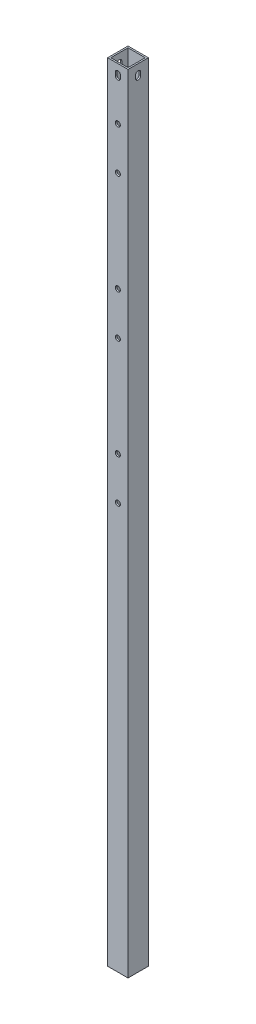
ISO-10303-21;
HEADER;
FILE_DESCRIPTION(('STEP AP214'),'2;1');
FILE_NAME('part.step','',(''),(''),'','','');
FILE_SCHEMA(('AUTOMOTIVE_DESIGN { 1 0 10303 214 1 1 1 1 }'));
ENDSEC;
DATA;
#1=APPLICATION_CONTEXT('core data for automotive mechanical design processes');
#2=APPLICATION_PROTOCOL_DEFINITION('international standard','automotive_design',2000,#1);
#3=PRODUCT_CONTEXT('',#1,'mechanical');
#4=PRODUCT('Part','Part','',(#3));
#5=PRODUCT_RELATED_PRODUCT_CATEGORY('part','',(#4));
#6=PRODUCT_DEFINITION_FORMATION('','',#4);
#7=PRODUCT_DEFINITION_CONTEXT('part definition',#1,'design');
#8=PRODUCT_DEFINITION('design','',#6,#7);
#9=PRODUCT_DEFINITION_SHAPE('','',#8);
#10=(LENGTH_UNIT() NAMED_UNIT(*) SI_UNIT(.MILLI.,.METRE.));
#11=(NAMED_UNIT(*) PLANE_ANGLE_UNIT() SI_UNIT($,.RADIAN.));
#12=(NAMED_UNIT(*) SI_UNIT($,.STERADIAN.) SOLID_ANGLE_UNIT());
#13=UNCERTAINTY_MEASURE_WITH_UNIT(LENGTH_MEASURE(1.E-05),#10,'distance_accuracy_value','');
#14=(GEOMETRIC_REPRESENTATION_CONTEXT(3) GLOBAL_UNCERTAINTY_ASSIGNED_CONTEXT((#13)) GLOBAL_UNIT_ASSIGNED_CONTEXT((#10,
#11,#12)) REPRESENTATION_CONTEXT('',''));
#15=CARTESIAN_POINT('',(0.,0.,0.));
#16=DIRECTION('',(0.,0.,1.));
#17=DIRECTION('',(1.,0.,0.));
#18=AXIS2_PLACEMENT_3D('',#15,#16,#17);
#19=CARTESIAN_POINT('',(0.,775.4,0.));
#20=DIRECTION('',(0.,1.,0.));
#21=DIRECTION('',(0.,0.,1.));
#22=AXIS2_PLACEMENT_3D('',#19,#20,#21);
#23=PLANE('',#22);
#24=DIRECTION('',(0.,0.,-1.));
#25=VECTOR('',#24,1.);
#26=CARTESIAN_POINT('',(10.,775.4,-10.));
#27=LINE('',#26,#25);
#28=CARTESIAN_POINT('',(10.,775.4,10.));
#29=VERTEX_POINT('',#28);
#30=CARTESIAN_POINT('',(10.,775.4,-10.));
#31=VERTEX_POINT('',#30);
#32=EDGE_CURVE('E350',#29,#31,#27,.T.);
#33=ORIENTED_EDGE('',*,*,#32,.T.);
#34=DIRECTION('',(-1.,0.,0.));
#35=VECTOR('',#34,1.);
#36=CARTESIAN_POINT('',(-10.,775.4,-10.));
#37=LINE('',#36,#35);
#38=CARTESIAN_POINT('',(-10.,775.4,-10.));
#39=VERTEX_POINT('',#38);
#40=EDGE_CURVE('E354',#31,#39,#37,.T.);
#41=ORIENTED_EDGE('',*,*,#40,.T.);
#42=DIRECTION('',(0.,0.,1.));
#43=VECTOR('',#42,1.);
#44=CARTESIAN_POINT('',(-10.,775.4,-10.));
#45=LINE('',#44,#43);
#46=CARTESIAN_POINT('',(-10.,775.4,10.));
#47=VERTEX_POINT('',#46);
#48=EDGE_CURVE('E358',#39,#47,#45,.T.);
#49=ORIENTED_EDGE('',*,*,#48,.T.);
#50=DIRECTION('',(1.,0.,0.));
#51=VECTOR('',#50,1.);
#52=CARTESIAN_POINT('',(-10.,775.4,10.));
#53=LINE('',#52,#51);
#54=EDGE_CURVE('E361',#47,#29,#53,.T.);
#55=ORIENTED_EDGE('',*,*,#54,.T.);
#56=EDGE_LOOP('',(#33,#41,#49,#55));
#57=FACE_BOUND('',#56,.T.);
#58=DIRECTION('',(1.,0.,0.));
#59=VECTOR('',#58,1.);
#60=CARTESIAN_POINT('',(-8.5,775.4,8.5));
#61=LINE('',#60,#59);
#62=CARTESIAN_POINT('',(-8.5,775.4,8.5));
#63=VERTEX_POINT('',#62);
#64=CARTESIAN_POINT('',(8.5,775.4,8.5));
#65=VERTEX_POINT('',#64);
#66=EDGE_CURVE('E310',#63,#65,#61,.T.);
#67=ORIENTED_EDGE('',*,*,#66,.F.);
#68=DIRECTION('',(0.,0.,1.));
#69=VECTOR('',#68,1.);
#70=CARTESIAN_POINT('',(-8.5,775.4,-8.5));
#71=LINE('',#70,#69);
#72=CARTESIAN_POINT('',(-8.5,775.4,-8.5));
#73=VERTEX_POINT('',#72);
#74=EDGE_CURVE('E307',#73,#63,#71,.T.);
#75=ORIENTED_EDGE('',*,*,#74,.F.);
#76=DIRECTION('',(-1.,0.,0.));
#77=VECTOR('',#76,1.);
#78=CARTESIAN_POINT('',(-8.5,775.4,-8.5));
#79=LINE('',#78,#77);
#80=CARTESIAN_POINT('',(8.5,775.4,-8.5));
#81=VERTEX_POINT('',#80);
#82=EDGE_CURVE('E318',#81,#73,#79,.T.);
#83=ORIENTED_EDGE('',*,*,#82,.F.);
#84=DIRECTION('',(0.,0.,-1.));
#85=VECTOR('',#84,1.);
#86=CARTESIAN_POINT('',(8.5,775.4,-8.5));
#87=LINE('',#86,#85);
#88=EDGE_CURVE('E314',#65,#81,#87,.T.);
#89=ORIENTED_EDGE('',*,*,#88,.F.);
#90=EDGE_LOOP('',(#67,#75,#83,#89));
#91=FACE_BOUND('',#90,.T.);
#92=ADVANCED_FACE('F45',(#57,#91),#23,.T.);
#93=CARTESIAN_POINT('',(0.,0.,0.));
#94=DIRECTION('',(0.,1.,0.));
#95=DIRECTION('',(0.,0.,1.));
#96=AXIS2_PLACEMENT_3D('',#93,#94,#95);
#97=PLANE('',#96);
#98=DIRECTION('',(0.,0.,-1.));
#99=VECTOR('',#98,1.);
#100=CARTESIAN_POINT('',(10.,0.,-10.));
#101=LINE('',#100,#99);
#102=CARTESIAN_POINT('',(10.,0.,10.));
#103=VERTEX_POINT('',#102);
#104=CARTESIAN_POINT('',(10.,0.,-10.));
#105=VERTEX_POINT('',#104);
#106=EDGE_CURVE('E349',#103,#105,#101,.T.);
#107=ORIENTED_EDGE('',*,*,#106,.F.);
#108=DIRECTION('',(1.,0.,0.));
#109=VECTOR('',#108,1.);
#110=CARTESIAN_POINT('',(-10.,0.,10.));
#111=LINE('',#110,#109);
#112=CARTESIAN_POINT('',(-10.,0.,10.));
#113=VERTEX_POINT('',#112);
#114=EDGE_CURVE('E355',#113,#103,#111,.T.);
#115=ORIENTED_EDGE('',*,*,#114,.F.);
#116=DIRECTION('',(0.,0.,1.));
#117=VECTOR('',#116,1.);
#118=CARTESIAN_POINT('',(-10.,0.,-10.));
#119=LINE('',#118,#117);
#120=CARTESIAN_POINT('',(-10.,0.,-10.));
#121=VERTEX_POINT('',#120);
#122=EDGE_CURVE('E371',#121,#113,#119,.T.);
#123=ORIENTED_EDGE('',*,*,#122,.F.);
#124=DIRECTION('',(-1.,0.,0.));
#125=VECTOR('',#124,1.);
#126=CARTESIAN_POINT('',(-10.,0.,-10.));
#127=LINE('',#126,#125);
#128=EDGE_CURVE('E368',#105,#121,#127,.T.);
#129=ORIENTED_EDGE('',*,*,#128,.F.);
#130=EDGE_LOOP('',(#107,#115,#123,#129));
#131=FACE_BOUND('',#130,.T.);
#132=DIRECTION('',(0.,0.,1.));
#133=VECTOR('',#132,1.);
#134=CARTESIAN_POINT('',(-8.5,0.,-8.5));
#135=LINE('',#134,#133);
#136=CARTESIAN_POINT('',(-8.5,0.,-8.5));
#137=VERTEX_POINT('',#136);
#138=CARTESIAN_POINT('',(-8.5,0.,8.5));
#139=VERTEX_POINT('',#138);
#140=EDGE_CURVE('E297',#137,#139,#135,.T.);
#141=ORIENTED_EDGE('',*,*,#140,.T.);
#142=DIRECTION('',(1.,0.,0.));
#143=VECTOR('',#142,1.);
#144=CARTESIAN_POINT('',(-8.5,0.,8.5));
#145=LINE('',#144,#143);
#146=CARTESIAN_POINT('',(8.5,0.,8.5));
#147=VERTEX_POINT('',#146);
#148=EDGE_CURVE('E325',#139,#147,#145,.T.);
#149=ORIENTED_EDGE('',*,*,#148,.T.);
#150=DIRECTION('',(0.,0.,-1.));
#151=VECTOR('',#150,1.);
#152=CARTESIAN_POINT('',(8.5,0.,-8.5));
#153=LINE('',#152,#151);
#154=CARTESIAN_POINT('',(8.5,0.,-8.5));
#155=VERTEX_POINT('',#154);
#156=EDGE_CURVE('E329',#147,#155,#153,.T.);
#157=ORIENTED_EDGE('',*,*,#156,.T.);
#158=DIRECTION('',(-1.,0.,0.));
#159=VECTOR('',#158,1.);
#160=CARTESIAN_POINT('',(-8.5,0.,-8.5));
#161=LINE('',#160,#159);
#162=EDGE_CURVE('E311',#155,#137,#161,.T.);
#163=ORIENTED_EDGE('',*,*,#162,.T.);
#164=EDGE_LOOP('',(#141,#149,#157,#163));
#165=FACE_BOUND('',#164,.T.);
#166=ADVANCED_FACE('F459',(#131,#165),#97,.F.);
#167=CARTESIAN_POINT('',(10.,775.4,-10.));
#168=DIRECTION('',(-1.,0.,0.));
#169=DIRECTION('',(0.,0.,1.));
#170=AXIS2_PLACEMENT_3D('',#167,#168,#169);
#171=PLANE('',#170);
#172=DIRECTION('',(0.,1.,0.));
#173=VECTOR('',#172,1.);
#174=CARTESIAN_POINT('',(10.,775.4,2.5));
#175=LINE('',#174,#173);
#176=CARTESIAN_POINT('',(9.99999999999999,763.9,2.5));
#177=VERTEX_POINT('',#176);
#178=CARTESIAN_POINT('',(9.99999999999999,766.9,2.5));
#179=VERTEX_POINT('',#178);
#180=EDGE_CURVE('E241',#177,#179,#175,.T.);
#181=ORIENTED_EDGE('',*,*,#180,.T.);
#182=CARTESIAN_POINT('',(9.99999999999999,766.9,0.));
#183=DIRECTION('',(-1.,0.,0.));
#184=DIRECTION('',(0.,0.,1.));
#185=AXIS2_PLACEMENT_3D('',#182,#183,#184);
#186=CIRCLE('',#185,2.5);
#187=CARTESIAN_POINT('',(9.99999999999999,766.9,-2.50000000000001));
#188=VERTEX_POINT('',#187);
#189=EDGE_CURVE('E248',#179,#188,#186,.T.);
#190=ORIENTED_EDGE('',*,*,#189,.T.);
#191=DIRECTION('',(0.,-1.,0.));
#192=VECTOR('',#191,1.);
#193=CARTESIAN_POINT('',(10.,775.4,-2.50000000000001));
#194=LINE('',#193,#192);
#195=CARTESIAN_POINT('',(10.,763.9,-2.5));
#196=VERTEX_POINT('',#195);
#197=EDGE_CURVE('E228',#188,#196,#194,.T.);
#198=ORIENTED_EDGE('',*,*,#197,.T.);
#199=CARTESIAN_POINT('',(9.99999999999999,763.9,0.));
#200=DIRECTION('',(-1.,0.,0.));
#201=DIRECTION('',(0.,0.,1.));
#202=AXIS2_PLACEMENT_3D('',#199,#200,#201);
#203=CIRCLE('',#202,2.5);
#204=EDGE_CURVE('E234',#196,#177,#203,.T.);
#205=ORIENTED_EDGE('',*,*,#204,.T.);
#206=EDGE_LOOP('',(#181,#190,#198,#205));
#207=FACE_BOUND('',#206,.T.);
#208=ORIENTED_EDGE('',*,*,#106,.T.);
#209=DIRECTION('',(0.,-1.,0.));
#210=VECTOR('',#209,1.);
#211=CARTESIAN_POINT('',(10.,775.4,-10.));
#212=LINE('',#211,#210);
#213=EDGE_CURVE('E387',#31,#105,#212,.T.);
#214=ORIENTED_EDGE('',*,*,#213,.F.);
#215=ORIENTED_EDGE('',*,*,#32,.F.);
#216=DIRECTION('',(0.,-1.,0.));
#217=VECTOR('',#216,1.);
#218=CARTESIAN_POINT('',(10.,775.4,10.));
#219=LINE('',#218,#217);
#220=EDGE_CURVE('E364',#29,#103,#219,.T.);
#221=ORIENTED_EDGE('',*,*,#220,.T.);
#222=EDGE_LOOP('',(#208,#214,#215,#221));
#223=FACE_BOUND('',#222,.T.);
#224=ADVANCED_FACE('F47',(#207,#223),#171,.F.);
#225=CARTESIAN_POINT('',(-10.,775.4,-10.));
#226=DIRECTION('',(0.,0.,1.));
#227=DIRECTION('',(1.,0.,0.));
#228=AXIS2_PLACEMENT_3D('',#225,#226,#227);
#229=PLANE('',#228);
#230=ORIENTED_EDGE('',*,*,#128,.T.);
#231=DIRECTION('',(0.,-1.,0.));
#232=VECTOR('',#231,1.);
#233=CARTESIAN_POINT('',(-10.,775.4,-10.));
#234=LINE('',#233,#232);
#235=EDGE_CURVE('E383',#39,#121,#234,.T.);
#236=ORIENTED_EDGE('',*,*,#235,.F.);
#237=ORIENTED_EDGE('',*,*,#40,.F.);
#238=ORIENTED_EDGE('',*,*,#213,.T.);
#239=EDGE_LOOP('',(#230,#236,#237,#238));
#240=FACE_BOUND('',#239,.T.);
#241=ADVANCED_FACE('F458',(#240),#229,.F.);
#242=CARTESIAN_POINT('',(-10.,775.4,-10.));
#243=DIRECTION('',(1.,0.,0.));
#244=DIRECTION('',(0.,0.,-1.));
#245=AXIS2_PLACEMENT_3D('',#242,#243,#244);
#246=PLANE('',#245);
#247=DIRECTION('',(0.,-1.,0.));
#248=VECTOR('',#247,1.);
#249=CARTESIAN_POINT('',(-10.,766.9,-2.5));
#250=LINE('',#249,#248);
#251=CARTESIAN_POINT('',(-10.,766.9,-2.5));
#252=VERTEX_POINT('',#251);
#253=CARTESIAN_POINT('',(-10.,763.9,-2.5));
#254=VERTEX_POINT('',#253);
#255=EDGE_CURVE('E199',#252,#254,#250,.T.);
#256=ORIENTED_EDGE('',*,*,#255,.F.);
#257=CARTESIAN_POINT('',(-10.,766.9,0.));
#258=DIRECTION('',(-1.,0.,0.));
#259=DIRECTION('',(0.,0.,1.));
#260=AXIS2_PLACEMENT_3D('',#257,#258,#259);
#261=CIRCLE('',#260,2.5);
#262=CARTESIAN_POINT('',(-10.,766.9,2.5));
#263=VERTEX_POINT('',#262);
#264=EDGE_CURVE('E69',#263,#252,#261,.T.);
#265=ORIENTED_EDGE('',*,*,#264,.F.);
#266=DIRECTION('',(0.,1.,0.));
#267=VECTOR('',#266,1.);
#268=CARTESIAN_POINT('',(-10.,766.9,2.5));
#269=LINE('',#268,#267);
#270=CARTESIAN_POINT('',(-10.,763.9,2.5));
#271=VERTEX_POINT('',#270);
#272=EDGE_CURVE('E208',#271,#263,#269,.T.);
#273=ORIENTED_EDGE('',*,*,#272,.F.);
#274=CARTESIAN_POINT('',(-10.,763.9,0.));
#275=DIRECTION('',(-1.,0.,0.));
#276=DIRECTION('',(0.,0.,1.));
#277=AXIS2_PLACEMENT_3D('',#274,#275,#276);
#278=CIRCLE('',#277,2.5);
#279=EDGE_CURVE('E189',#254,#271,#278,.T.);
#280=ORIENTED_EDGE('',*,*,#279,.F.);
#281=EDGE_LOOP('',(#256,#265,#273,#280));
#282=FACE_BOUND('',#281,.T.);
#283=ORIENTED_EDGE('',*,*,#122,.T.);
#284=DIRECTION('',(0.,-1.,0.));
#285=VECTOR('',#284,1.);
#286=CARTESIAN_POINT('',(-10.,775.4,10.));
#287=LINE('',#286,#285);
#288=EDGE_CURVE('E379',#47,#113,#287,.T.);
#289=ORIENTED_EDGE('',*,*,#288,.F.);
#290=ORIENTED_EDGE('',*,*,#48,.F.);
#291=ORIENTED_EDGE('',*,*,#235,.T.);
#292=EDGE_LOOP('',(#283,#289,#290,#291));
#293=FACE_BOUND('',#292,.T.);
#294=ADVANCED_FACE('F205',(#282,#293),#246,.F.);
#295=CARTESIAN_POINT('',(-10.,775.4,10.));
#296=DIRECTION('',(0.,0.,-1.));
#297=DIRECTION('',(-1.,0.,0.));
#298=AXIS2_PLACEMENT_3D('',#295,#296,#297);
#299=PLANE('',#298);
#300=CARTESIAN_POINT('',(0.,723.9,10.));
#301=DIRECTION('',(0.,0.,1.));
#302=DIRECTION('',(1.,0.,0.));
#303=AXIS2_PLACEMENT_3D('',#300,#301,#302);
#304=CIRCLE('',#303,2.5);
#305=CARTESIAN_POINT('',(2.50000000000001,723.9,10.));
#306=VERTEX_POINT('',#305);
#307=EDGE_CURVE('E253',#306,#306,#304,.T.);
#308=ORIENTED_EDGE('',*,*,#307,.F.);
#309=EDGE_LOOP('',(#308));
#310=FACE_BOUND('',#309,.T.);
#311=CARTESIAN_POINT('',(0.,583.1,10.));
#312=DIRECTION('',(0.,0.,1.));
#313=DIRECTION('',(1.,0.,0.));
#314=AXIS2_PLACEMENT_3D('',#311,#312,#313);
#315=CIRCLE('',#314,2.5);
#316=CARTESIAN_POINT('',(2.50000000000001,583.1,10.));
#317=VERTEX_POINT('',#316);
#318=EDGE_CURVE('E252',#317,#317,#315,.T.);
#319=ORIENTED_EDGE('',*,*,#318,.F.);
#320=EDGE_LOOP('',(#319));
#321=FACE_BOUND('',#320,.T.);
#322=CARTESIAN_POINT('',(0.,400.3,10.));
#323=DIRECTION('',(0.,0.,1.));
#324=DIRECTION('',(1.,0.,0.));
#325=AXIS2_PLACEMENT_3D('',#322,#323,#324);
#326=CIRCLE('',#325,2.5);
#327=CARTESIAN_POINT('',(2.50000000000001,400.3,10.));
#328=VERTEX_POINT('',#327);
#329=EDGE_CURVE('E262',#328,#328,#326,.T.);
#330=ORIENTED_EDGE('',*,*,#329,.F.);
#331=EDGE_LOOP('',(#330));
#332=FACE_BOUND('',#331,.T.);
#333=CARTESIAN_POINT('',(0.,442.3,10.));
#334=DIRECTION('',(0.,0.,1.));
#335=DIRECTION('',(1.,0.,0.));
#336=AXIS2_PLACEMENT_3D('',#333,#334,#335);
#337=CIRCLE('',#336,2.5);
#338=CARTESIAN_POINT('',(2.50000000000001,442.3,10.));
#339=VERTEX_POINT('',#338);
#340=EDGE_CURVE('E270',#339,#339,#337,.T.);
#341=ORIENTED_EDGE('',*,*,#340,.F.);
#342=EDGE_LOOP('',(#341));
#343=FACE_BOUND('',#342,.T.);
#344=CARTESIAN_POINT('',(0.,541.1,10.));
#345=DIRECTION('',(0.,0.,1.));
#346=DIRECTION('',(1.,0.,0.));
#347=AXIS2_PLACEMENT_3D('',#344,#345,#346);
#348=CIRCLE('',#347,2.5);
#349=CARTESIAN_POINT('',(2.50000000000001,541.1,10.));
#350=VERTEX_POINT('',#349);
#351=EDGE_CURVE('E266',#350,#350,#348,.T.);
#352=ORIENTED_EDGE('',*,*,#351,.F.);
#353=EDGE_LOOP('',(#352));
#354=FACE_BOUND('',#353,.T.);
#355=CARTESIAN_POINT('',(0.,681.9,10.));
#356=DIRECTION('',(0.,0.,1.));
#357=DIRECTION('',(1.,0.,0.));
#358=AXIS2_PLACEMENT_3D('',#355,#356,#357);
#359=CIRCLE('',#358,2.5);
#360=CARTESIAN_POINT('',(2.50000000000001,681.9,10.));
#361=VERTEX_POINT('',#360);
#362=EDGE_CURVE('E258',#361,#361,#359,.T.);
#363=ORIENTED_EDGE('',*,*,#362,.F.);
#364=EDGE_LOOP('',(#363));
#365=FACE_BOUND('',#364,.T.);
#366=DIRECTION('',(0.,-1.,0.));
#367=VECTOR('',#366,1.);
#368=CARTESIAN_POINT('',(-2.5,766.9,10.));
#369=LINE('',#368,#367);
#370=CARTESIAN_POINT('',(-2.5,766.9,10.));
#371=VERTEX_POINT('',#370);
#372=CARTESIAN_POINT('',(-2.5,763.9,10.));
#373=VERTEX_POINT('',#372);
#374=EDGE_CURVE('E280',#371,#373,#369,.T.);
#375=ORIENTED_EDGE('',*,*,#374,.F.);
#376=CARTESIAN_POINT('',(0.,766.9,10.));
#377=DIRECTION('',(0.,0.,1.));
#378=DIRECTION('',(1.,0.,0.));
#379=AXIS2_PLACEMENT_3D('',#376,#377,#378);
#380=CIRCLE('',#379,2.5);
#381=CARTESIAN_POINT('',(2.5,766.9,10.));
#382=VERTEX_POINT('',#381);
#383=EDGE_CURVE('E277',#382,#371,#380,.T.);
#384=ORIENTED_EDGE('',*,*,#383,.F.);
#385=DIRECTION('',(0.,1.,0.));
#386=VECTOR('',#385,1.);
#387=CARTESIAN_POINT('',(2.5,766.9,10.));
#388=LINE('',#387,#386);
#389=CARTESIAN_POINT('',(2.5,763.9,10.));
#390=VERTEX_POINT('',#389);
#391=EDGE_CURVE('E289',#390,#382,#388,.T.);
#392=ORIENTED_EDGE('',*,*,#391,.F.);
#393=CARTESIAN_POINT('',(0.,763.9,10.));
#394=DIRECTION('',(0.,0.,1.));
#395=DIRECTION('',(1.,0.,0.));
#396=AXIS2_PLACEMENT_3D('',#393,#394,#395);
#397=CIRCLE('',#396,2.5);
#398=EDGE_CURVE('E285',#373,#390,#397,.T.);
#399=ORIENTED_EDGE('',*,*,#398,.F.);
#400=EDGE_LOOP('',(#375,#384,#392,#399));
#401=FACE_BOUND('',#400,.T.);
#402=ORIENTED_EDGE('',*,*,#114,.T.);
#403=ORIENTED_EDGE('',*,*,#220,.F.);
#404=ORIENTED_EDGE('',*,*,#54,.F.);
#405=ORIENTED_EDGE('',*,*,#288,.T.);
#406=EDGE_LOOP('',(#402,#403,#404,#405));
#407=FACE_BOUND('',#406,.T.);
#408=ADVANCED_FACE('F476',(#310,#321,#332,#343,#354,#365,#401,#407),#299,.F.);
#409=CARTESIAN_POINT('',(-8.5,775.4,-8.5));
#410=DIRECTION('',(1.,0.,0.));
#411=DIRECTION('',(0.,0.,-1.));
#412=AXIS2_PLACEMENT_3D('',#409,#410,#411);
#413=PLANE('',#412);
#414=CARTESIAN_POINT('',(-8.49999999999999,766.9,0.));
#415=DIRECTION('',(1.,0.,0.));
#416=DIRECTION('',(0.,0.,-1.));
#417=AXIS2_PLACEMENT_3D('',#414,#415,#416);
#418=CIRCLE('',#417,2.5);
#419=CARTESIAN_POINT('',(-8.49999999999999,766.9,-2.5));
#420=VERTEX_POINT('',#419);
#421=CARTESIAN_POINT('',(-8.49999999999999,766.9,2.5));
#422=VERTEX_POINT('',#421);
#423=EDGE_CURVE('E245',#420,#422,#418,.T.);
#424=ORIENTED_EDGE('',*,*,#423,.F.);
#425=DIRECTION('',(0.,1.,0.));
#426=VECTOR('',#425,1.);
#427=CARTESIAN_POINT('',(-8.5,775.4,-2.50000000000001));
#428=LINE('',#427,#426);
#429=CARTESIAN_POINT('',(-8.5,763.9,-2.5));
#430=VERTEX_POINT('',#429);
#431=EDGE_CURVE('E225',#430,#420,#428,.T.);
#432=ORIENTED_EDGE('',*,*,#431,.F.);
#433=CARTESIAN_POINT('',(-8.49999999999999,763.9,0.));
#434=DIRECTION('',(1.,0.,0.));
#435=DIRECTION('',(0.,0.,-1.));
#436=AXIS2_PLACEMENT_3D('',#433,#434,#435);
#437=CIRCLE('',#436,2.5);
#438=CARTESIAN_POINT('',(-8.49999999999999,763.9,2.5));
#439=VERTEX_POINT('',#438);
#440=EDGE_CURVE('E192',#439,#430,#437,.T.);
#441=ORIENTED_EDGE('',*,*,#440,.F.);
#442=DIRECTION('',(0.,-1.,0.));
#443=VECTOR('',#442,1.);
#444=CARTESIAN_POINT('',(-8.5,775.4,2.5));
#445=LINE('',#444,#443);
#446=EDGE_CURVE('E238',#422,#439,#445,.T.);
#447=ORIENTED_EDGE('',*,*,#446,.F.);
#448=EDGE_LOOP('',(#424,#432,#441,#447));
#449=FACE_BOUND('',#448,.T.);
#450=ORIENTED_EDGE('',*,*,#140,.F.);
#451=DIRECTION('',(0.,-1.,0.));
#452=VECTOR('',#451,1.);
#453=CARTESIAN_POINT('',(-8.5,775.4,-8.5));
#454=LINE('',#453,#452);
#455=EDGE_CURVE('E321',#73,#137,#454,.T.);
#456=ORIENTED_EDGE('',*,*,#455,.F.);
#457=ORIENTED_EDGE('',*,*,#74,.T.);
#458=DIRECTION('',(0.,-1.,0.));
#459=VECTOR('',#458,1.);
#460=CARTESIAN_POINT('',(-8.5,775.4,8.5));
#461=LINE('',#460,#459);
#462=EDGE_CURVE('E345',#63,#139,#461,.T.);
#463=ORIENTED_EDGE('',*,*,#462,.T.);
#464=EDGE_LOOP('',(#450,#456,#457,#463));
#465=FACE_BOUND('',#464,.T.);
#466=ADVANCED_FACE('F483',(#449,#465),#413,.T.);
#467=CARTESIAN_POINT('',(-8.5,775.4,8.5));
#468=DIRECTION('',(0.,0.,-1.));
#469=DIRECTION('',(-1.,0.,0.));
#470=AXIS2_PLACEMENT_3D('',#467,#468,#469);
#471=PLANE('',#470);
#472=CARTESIAN_POINT('',(0.,723.9,8.5));
#473=DIRECTION('',(0.,0.,-1.));
#474=DIRECTION('',(-1.,0.,0.));
#475=AXIS2_PLACEMENT_3D('',#472,#473,#474);
#476=CIRCLE('',#475,2.5);
#477=CARTESIAN_POINT('',(-2.5,723.9,8.5));
#478=VERTEX_POINT('',#477);
#479=EDGE_CURVE('E281',#478,#478,#476,.T.);
#480=ORIENTED_EDGE('',*,*,#479,.F.);
#481=EDGE_LOOP('',(#480));
#482=FACE_BOUND('',#481,.T.);
#483=CARTESIAN_POINT('',(0.,583.1,8.5));
#484=DIRECTION('',(0.,0.,-1.));
#485=DIRECTION('',(-1.,0.,0.));
#486=AXIS2_PLACEMENT_3D('',#483,#484,#485);
#487=CIRCLE('',#486,2.5);
#488=CARTESIAN_POINT('',(-2.5,583.1,8.5));
#489=VERTEX_POINT('',#488);
#490=EDGE_CURVE('E420',#489,#489,#487,.T.);
#491=ORIENTED_EDGE('',*,*,#490,.F.);
#492=EDGE_LOOP('',(#491));
#493=FACE_BOUND('',#492,.T.);
#494=CARTESIAN_POINT('',(0.,400.3,8.5));
#495=DIRECTION('',(0.,0.,-1.));
#496=DIRECTION('',(-1.,0.,0.));
#497=AXIS2_PLACEMENT_3D('',#494,#495,#496);
#498=CIRCLE('',#497,2.5);
#499=CARTESIAN_POINT('',(-2.5,400.3,8.5));
#500=VERTEX_POINT('',#499);
#501=EDGE_CURVE('E416',#500,#500,#498,.T.);
#502=ORIENTED_EDGE('',*,*,#501,.F.);
#503=EDGE_LOOP('',(#502));
#504=FACE_BOUND('',#503,.T.);
#505=CARTESIAN_POINT('',(0.,442.3,8.5));
#506=DIRECTION('',(0.,0.,-1.));
#507=DIRECTION('',(-1.,0.,0.));
#508=AXIS2_PLACEMENT_3D('',#505,#506,#507);
#509=CIRCLE('',#508,2.5);
#510=CARTESIAN_POINT('',(-2.5,442.3,8.5));
#511=VERTEX_POINT('',#510);
#512=EDGE_CURVE('E412',#511,#511,#509,.T.);
#513=ORIENTED_EDGE('',*,*,#512,.F.);
#514=EDGE_LOOP('',(#513));
#515=FACE_BOUND('',#514,.T.);
#516=CARTESIAN_POINT('',(0.,541.1,8.5));
#517=DIRECTION('',(0.,0.,-1.));
#518=DIRECTION('',(-1.,0.,0.));
#519=AXIS2_PLACEMENT_3D('',#516,#517,#518);
#520=CIRCLE('',#519,2.5);
#521=CARTESIAN_POINT('',(-2.5,541.1,8.5));
#522=VERTEX_POINT('',#521);
#523=EDGE_CURVE('E408',#522,#522,#520,.T.);
#524=ORIENTED_EDGE('',*,*,#523,.F.);
#525=EDGE_LOOP('',(#524));
#526=FACE_BOUND('',#525,.T.);
#527=CARTESIAN_POINT('',(0.,681.9,8.5));
#528=DIRECTION('',(0.,0.,-1.));
#529=DIRECTION('',(-1.,0.,0.));
#530=AXIS2_PLACEMENT_3D('',#527,#528,#529);
#531=CIRCLE('',#530,2.5);
#532=CARTESIAN_POINT('',(-2.5,681.9,8.5));
#533=VERTEX_POINT('',#532);
#534=EDGE_CURVE('E257',#533,#533,#531,.T.);
#535=ORIENTED_EDGE('',*,*,#534,.F.);
#536=EDGE_LOOP('',(#535));
#537=FACE_BOUND('',#536,.T.);
#538=CARTESIAN_POINT('',(0.,766.9,8.5));
#539=DIRECTION('',(0.,0.,-1.));
#540=DIRECTION('',(-1.,0.,0.));
#541=AXIS2_PLACEMENT_3D('',#538,#539,#540);
#542=CIRCLE('',#541,2.5);
#543=CARTESIAN_POINT('',(-2.5,766.9,8.5));
#544=VERTEX_POINT('',#543);
#545=CARTESIAN_POINT('',(2.5,766.9,8.5));
#546=VERTEX_POINT('',#545);
#547=EDGE_CURVE('E401',#544,#546,#542,.T.);
#548=ORIENTED_EDGE('',*,*,#547,.F.);
#549=DIRECTION('',(0.,1.,0.));
#550=VECTOR('',#549,1.);
#551=CARTESIAN_POINT('',(-2.50000000000001,775.4,8.5));
#552=LINE('',#551,#550);
#553=CARTESIAN_POINT('',(-2.5,763.9,8.5));
#554=VERTEX_POINT('',#553);
#555=EDGE_CURVE('E391',#554,#544,#552,.T.);
#556=ORIENTED_EDGE('',*,*,#555,.F.);
#557=CARTESIAN_POINT('',(0.,763.9,8.5));
#558=DIRECTION('',(0.,0.,-1.));
#559=DIRECTION('',(-1.,0.,0.));
#560=AXIS2_PLACEMENT_3D('',#557,#558,#559);
#561=CIRCLE('',#560,2.5);
#562=CARTESIAN_POINT('',(2.5,763.9,8.5));
#563=VERTEX_POINT('',#562);
#564=EDGE_CURVE('E394',#563,#554,#561,.T.);
#565=ORIENTED_EDGE('',*,*,#564,.F.);
#566=DIRECTION('',(0.,-1.,0.));
#567=VECTOR('',#566,1.);
#568=CARTESIAN_POINT('',(2.5,775.4,8.5));
#569=LINE('',#568,#567);
#570=EDGE_CURVE('E398',#546,#563,#569,.T.);
#571=ORIENTED_EDGE('',*,*,#570,.F.);
#572=EDGE_LOOP('',(#548,#556,#565,#571));
#573=FACE_BOUND('',#572,.T.);
#574=ORIENTED_EDGE('',*,*,#148,.F.);
#575=ORIENTED_EDGE('',*,*,#462,.F.);
#576=ORIENTED_EDGE('',*,*,#66,.T.);
#577=DIRECTION('',(0.,-1.,0.));
#578=VECTOR('',#577,1.);
#579=CARTESIAN_POINT('',(8.5,775.4,8.5));
#580=LINE('',#579,#578);
#581=EDGE_CURVE('E342',#65,#147,#580,.T.);
#582=ORIENTED_EDGE('',*,*,#581,.T.);
#583=EDGE_LOOP('',(#574,#575,#576,#582));
#584=FACE_BOUND('',#583,.T.);
#585=ADVANCED_FACE('F495',(#482,#493,#504,#515,#526,#537,#573,#584),#471,.T.);
#586=CARTESIAN_POINT('',(8.5,775.4,-8.5));
#587=DIRECTION('',(-1.,0.,0.));
#588=DIRECTION('',(0.,0.,1.));
#589=AXIS2_PLACEMENT_3D('',#586,#587,#588);
#590=PLANE('',#589);
#591=CARTESIAN_POINT('',(8.49999999999999,766.9,0.));
#592=DIRECTION('',(-1.,0.,0.));
#593=DIRECTION('',(0.,0.,1.));
#594=AXIS2_PLACEMENT_3D('',#591,#592,#593);
#595=CIRCLE('',#594,2.5);
#596=CARTESIAN_POINT('',(8.49999999999999,766.9,2.5));
#597=VERTEX_POINT('',#596);
#598=CARTESIAN_POINT('',(8.5,766.9,-2.5));
#599=VERTEX_POINT('',#598);
#600=EDGE_CURVE('E11',#597,#599,#595,.T.);
#601=ORIENTED_EDGE('',*,*,#600,.F.);
#602=DIRECTION('',(0.,1.,0.));
#603=VECTOR('',#602,1.);
#604=CARTESIAN_POINT('',(8.5,775.4,2.5));
#605=LINE('',#604,#603);
#606=CARTESIAN_POINT('',(8.49999999999999,763.9,2.5));
#607=VERTEX_POINT('',#606);
#608=EDGE_CURVE('E54',#607,#597,#605,.T.);
#609=ORIENTED_EDGE('',*,*,#608,.F.);
#610=CARTESIAN_POINT('',(8.49999999999999,763.9,0.));
#611=DIRECTION('',(-1.,0.,0.));
#612=DIRECTION('',(0.,0.,1.));
#613=AXIS2_PLACEMENT_3D('',#610,#611,#612);
#614=CIRCLE('',#613,2.5);
#615=CARTESIAN_POINT('',(8.49999999999999,763.9,-2.5));
#616=VERTEX_POINT('',#615);
#617=EDGE_CURVE('E429',#616,#607,#614,.T.);
#618=ORIENTED_EDGE('',*,*,#617,.F.);
#619=DIRECTION('',(0.,-1.,0.));
#620=VECTOR('',#619,1.);
#621=CARTESIAN_POINT('',(8.5,775.4,-2.50000000000001));
#622=LINE('',#621,#620);
#623=EDGE_CURVE('E404',#599,#616,#622,.T.);
#624=ORIENTED_EDGE('',*,*,#623,.F.);
#625=EDGE_LOOP('',(#601,#609,#618,#624));
#626=FACE_BOUND('',#625,.T.);
#627=ORIENTED_EDGE('',*,*,#156,.F.);
#628=ORIENTED_EDGE('',*,*,#581,.F.);
#629=ORIENTED_EDGE('',*,*,#88,.T.);
#630=DIRECTION('',(0.,-1.,0.));
#631=VECTOR('',#630,1.);
#632=CARTESIAN_POINT('',(8.5,775.4,-8.5));
#633=LINE('',#632,#631);
#634=EDGE_CURVE('E339',#81,#155,#633,.T.);
#635=ORIENTED_EDGE('',*,*,#634,.T.);
#636=EDGE_LOOP('',(#627,#628,#629,#635));
#637=FACE_BOUND('',#636,.T.);
#638=ADVANCED_FACE('F447',(#626,#637),#590,.T.);
#639=CARTESIAN_POINT('',(-8.5,775.4,-8.5));
#640=DIRECTION('',(0.,0.,1.));
#641=DIRECTION('',(1.,0.,0.));
#642=AXIS2_PLACEMENT_3D('',#639,#640,#641);
#643=PLANE('',#642);
#644=ORIENTED_EDGE('',*,*,#162,.F.);
#645=ORIENTED_EDGE('',*,*,#634,.F.);
#646=ORIENTED_EDGE('',*,*,#82,.T.);
#647=ORIENTED_EDGE('',*,*,#455,.T.);
#648=EDGE_LOOP('',(#644,#645,#646,#647));
#649=FACE_BOUND('',#648,.T.);
#650=ADVANCED_FACE('F502',(#649),#643,.T.);
#651=CARTESIAN_POINT('',(0.,766.9,5.));
#652=DIRECTION('',(0.,0.,1.));
#653=DIRECTION('',(1.,0.,0.));
#654=AXIS2_PLACEMENT_3D('',#651,#652,#653);
#655=CYLINDRICAL_SURFACE('',#654,2.5);
#656=ORIENTED_EDGE('',*,*,#547,.T.);
#657=DIRECTION('',(0.,0.,1.));
#658=VECTOR('',#657,1.);
#659=CARTESIAN_POINT('',(2.5,766.9,5.));
#660=LINE('',#659,#658);
#661=EDGE_CURVE('E294',#546,#382,#660,.T.);
#662=ORIENTED_EDGE('',*,*,#661,.T.);
#663=ORIENTED_EDGE('',*,*,#383,.T.);
#664=DIRECTION('',(0.,0.,1.));
#665=VECTOR('',#664,1.);
#666=CARTESIAN_POINT('',(-2.5,766.9,5.));
#667=LINE('',#666,#665);
#668=EDGE_CURVE('E293',#544,#371,#667,.T.);
#669=ORIENTED_EDGE('',*,*,#668,.F.);
#670=EDGE_LOOP('',(#656,#662,#663,#669));
#671=FACE_BOUND('',#670,.T.);
#672=ADVANCED_FACE('F505',(#671),#655,.F.);
#673=CARTESIAN_POINT('',(2.5,766.9,5.));
#674=DIRECTION('',(1.,0.,0.));
#675=DIRECTION('',(0.,1.,0.));
#676=AXIS2_PLACEMENT_3D('',#673,#674,#675);
#677=PLANE('',#676);
#678=ORIENTED_EDGE('',*,*,#570,.T.);
#679=DIRECTION('',(0.,0.,1.));
#680=VECTOR('',#679,1.);
#681=CARTESIAN_POINT('',(2.5,763.9,5.));
#682=LINE('',#681,#680);
#683=EDGE_CURVE('E298',#563,#390,#682,.T.);
#684=ORIENTED_EDGE('',*,*,#683,.T.);
#685=ORIENTED_EDGE('',*,*,#391,.T.);
#686=ORIENTED_EDGE('',*,*,#661,.F.);
#687=EDGE_LOOP('',(#678,#684,#685,#686));
#688=FACE_BOUND('',#687,.T.);
#689=ADVANCED_FACE('F509',(#688),#677,.F.);
#690=CARTESIAN_POINT('',(0.,763.9,5.));
#691=DIRECTION('',(0.,0.,1.));
#692=DIRECTION('',(1.,0.,0.));
#693=AXIS2_PLACEMENT_3D('',#690,#691,#692);
#694=CYLINDRICAL_SURFACE('',#693,2.5);
#695=ORIENTED_EDGE('',*,*,#564,.T.);
#696=DIRECTION('',(0.,0.,1.));
#697=VECTOR('',#696,1.);
#698=CARTESIAN_POINT('',(-2.5,763.9,5.));
#699=LINE('',#698,#697);
#700=EDGE_CURVE('E301',#554,#373,#699,.T.);
#701=ORIENTED_EDGE('',*,*,#700,.T.);
#702=ORIENTED_EDGE('',*,*,#398,.T.);
#703=ORIENTED_EDGE('',*,*,#683,.F.);
#704=EDGE_LOOP('',(#695,#701,#702,#703));
#705=FACE_BOUND('',#704,.T.);
#706=ADVANCED_FACE('F515',(#705),#694,.F.);
#707=CARTESIAN_POINT('',(-2.5,766.9,5.));
#708=DIRECTION('',(-1.,0.,0.));
#709=DIRECTION('',(0.,-1.,0.));
#710=AXIS2_PLACEMENT_3D('',#707,#708,#709);
#711=PLANE('',#710);
#712=ORIENTED_EDGE('',*,*,#555,.T.);
#713=ORIENTED_EDGE('',*,*,#668,.T.);
#714=ORIENTED_EDGE('',*,*,#374,.T.);
#715=ORIENTED_EDGE('',*,*,#700,.F.);
#716=EDGE_LOOP('',(#712,#713,#714,#715));
#717=FACE_BOUND('',#716,.T.);
#718=ADVANCED_FACE('F511',(#717),#711,.F.);
#719=CARTESIAN_POINT('',(0.,681.9,5.));
#720=DIRECTION('',(0.,0.,1.));
#721=DIRECTION('',(1.,0.,0.));
#722=AXIS2_PLACEMENT_3D('',#719,#720,#721);
#723=CYLINDRICAL_SURFACE('',#722,2.5);
#724=ORIENTED_EDGE('',*,*,#534,.T.);
#725=EDGE_LOOP('',(#724));
#726=FACE_BOUND('',#725,.T.);
#727=ORIENTED_EDGE('',*,*,#362,.T.);
#728=EDGE_LOOP('',(#727));
#729=FACE_BOUND('',#728,.T.);
#730=ADVANCED_FACE('F514',(#726,#729),#723,.F.);
#731=CARTESIAN_POINT('',(0.,541.1,5.));
#732=DIRECTION('',(0.,0.,1.));
#733=DIRECTION('',(1.,0.,0.));
#734=AXIS2_PLACEMENT_3D('',#731,#732,#733);
#735=CYLINDRICAL_SURFACE('',#734,2.5);
#736=ORIENTED_EDGE('',*,*,#523,.T.);
#737=EDGE_LOOP('',(#736));
#738=FACE_BOUND('',#737,.T.);
#739=ORIENTED_EDGE('',*,*,#351,.T.);
#740=EDGE_LOOP('',(#739));
#741=FACE_BOUND('',#740,.T.);
#742=ADVANCED_FACE('F531',(#738,#741),#735,.F.);
#743=CARTESIAN_POINT('',(0.,442.3,5.));
#744=DIRECTION('',(0.,0.,1.));
#745=DIRECTION('',(1.,0.,0.));
#746=AXIS2_PLACEMENT_3D('',#743,#744,#745);
#747=CYLINDRICAL_SURFACE('',#746,2.5);
#748=ORIENTED_EDGE('',*,*,#512,.T.);
#749=EDGE_LOOP('',(#748));
#750=FACE_BOUND('',#749,.T.);
#751=ORIENTED_EDGE('',*,*,#340,.T.);
#752=EDGE_LOOP('',(#751));
#753=FACE_BOUND('',#752,.T.);
#754=ADVANCED_FACE('F527',(#750,#753),#747,.F.);
#755=CARTESIAN_POINT('',(0.,400.3,5.));
#756=DIRECTION('',(0.,0.,1.));
#757=DIRECTION('',(1.,0.,0.));
#758=AXIS2_PLACEMENT_3D('',#755,#756,#757);
#759=CYLINDRICAL_SURFACE('',#758,2.5);
#760=ORIENTED_EDGE('',*,*,#501,.T.);
#761=EDGE_LOOP('',(#760));
#762=FACE_BOUND('',#761,.T.);
#763=ORIENTED_EDGE('',*,*,#329,.T.);
#764=EDGE_LOOP('',(#763));
#765=FACE_BOUND('',#764,.T.);
#766=ADVANCED_FACE('F523',(#762,#765),#759,.F.);
#767=CARTESIAN_POINT('',(0.,583.1,5.));
#768=DIRECTION('',(0.,0.,1.));
#769=DIRECTION('',(1.,0.,0.));
#770=AXIS2_PLACEMENT_3D('',#767,#768,#769);
#771=CYLINDRICAL_SURFACE('',#770,2.5);
#772=ORIENTED_EDGE('',*,*,#490,.T.);
#773=EDGE_LOOP('',(#772));
#774=FACE_BOUND('',#773,.T.);
#775=ORIENTED_EDGE('',*,*,#318,.T.);
#776=EDGE_LOOP('',(#775));
#777=FACE_BOUND('',#776,.T.);
#778=ADVANCED_FACE('F526',(#774,#777),#771,.F.);
#779=CARTESIAN_POINT('',(0.,723.9,5.));
#780=DIRECTION('',(0.,0.,1.));
#781=DIRECTION('',(1.,0.,0.));
#782=AXIS2_PLACEMENT_3D('',#779,#780,#781);
#783=CYLINDRICAL_SURFACE('',#782,2.5);
#784=ORIENTED_EDGE('',*,*,#479,.T.);
#785=EDGE_LOOP('',(#784));
#786=FACE_BOUND('',#785,.T.);
#787=ORIENTED_EDGE('',*,*,#307,.T.);
#788=EDGE_LOOP('',(#787));
#789=FACE_BOUND('',#788,.T.);
#790=ADVANCED_FACE('F541',(#786,#789),#783,.F.);
#791=CARTESIAN_POINT('',(91.,766.9,-2.50000000000002));
#792=DIRECTION('',(0.,0.,-1.));
#793=DIRECTION('',(0.,1.,0.));
#794=AXIS2_PLACEMENT_3D('',#791,#792,#793);
#795=PLANE('',#794);
#796=DIRECTION('',(-1.,0.,0.));
#797=VECTOR('',#796,1.);
#798=CARTESIAN_POINT('',(91.,766.9,-2.50000000000002));
#799=LINE('',#798,#797);
#800=EDGE_CURVE('E196',#188,#599,#799,.T.);
#801=ORIENTED_EDGE('',*,*,#800,.T.);
#802=ORIENTED_EDGE('',*,*,#623,.T.);
#803=DIRECTION('',(-1.,0.,0.));
#804=VECTOR('',#803,1.);
#805=CARTESIAN_POINT('',(91.,763.9,-2.50000000000001));
#806=LINE('',#805,#804);
#807=EDGE_CURVE('E61',#196,#616,#806,.T.);
#808=ORIENTED_EDGE('',*,*,#807,.F.);
#809=ORIENTED_EDGE('',*,*,#197,.F.);
#810=EDGE_LOOP('',(#801,#802,#808,#809));
#811=FACE_BOUND('',#810,.T.);
#812=ADVANCED_FACE('F449',(#811),#795,.F.);
#813=CARTESIAN_POINT('',(91.,763.9,0.));
#814=DIRECTION('',(-1.,0.,0.));
#815=DIRECTION('',(0.,0.,1.));
#816=AXIS2_PLACEMENT_3D('',#813,#814,#815);
#817=CYLINDRICAL_SURFACE('',#816,2.5);
#818=ORIENTED_EDGE('',*,*,#807,.T.);
#819=ORIENTED_EDGE('',*,*,#617,.T.);
#820=DIRECTION('',(-1.,0.,0.));
#821=VECTOR('',#820,1.);
#822=CARTESIAN_POINT('',(91.,763.9,2.49999999999999));
#823=LINE('',#822,#821);
#824=EDGE_CURVE('E219',#177,#607,#823,.T.);
#825=ORIENTED_EDGE('',*,*,#824,.F.);
#826=ORIENTED_EDGE('',*,*,#204,.F.);
#827=EDGE_LOOP('',(#818,#819,#825,#826));
#828=FACE_BOUND('',#827,.T.);
#829=ADVANCED_FACE('F451',(#828),#817,.F.);
#830=CARTESIAN_POINT('',(91.,766.9,2.49999999999999));
#831=DIRECTION('',(0.,0.,1.));
#832=DIRECTION('',(1.,0.,0.));
#833=AXIS2_PLACEMENT_3D('',#830,#831,#832);
#834=PLANE('',#833);
#835=ORIENTED_EDGE('',*,*,#824,.T.);
#836=ORIENTED_EDGE('',*,*,#608,.T.);
#837=DIRECTION('',(-1.,0.,0.));
#838=VECTOR('',#837,1.);
#839=CARTESIAN_POINT('',(91.,766.9,2.49999999999999));
#840=LINE('',#839,#838);
#841=EDGE_CURVE('E218',#179,#597,#840,.T.);
#842=ORIENTED_EDGE('',*,*,#841,.F.);
#843=ORIENTED_EDGE('',*,*,#180,.F.);
#844=EDGE_LOOP('',(#835,#836,#842,#843));
#845=FACE_BOUND('',#844,.T.);
#846=ADVANCED_FACE('F437',(#845),#834,.F.);
#847=CARTESIAN_POINT('',(91.,766.9,0.));
#848=DIRECTION('',(-1.,0.,0.));
#849=DIRECTION('',(0.,0.,1.));
#850=AXIS2_PLACEMENT_3D('',#847,#848,#849);
#851=CYLINDRICAL_SURFACE('',#850,2.5);
#852=ORIENTED_EDGE('',*,*,#841,.T.);
#853=ORIENTED_EDGE('',*,*,#600,.T.);
#854=ORIENTED_EDGE('',*,*,#800,.F.);
#855=ORIENTED_EDGE('',*,*,#189,.F.);
#856=EDGE_LOOP('',(#852,#853,#854,#855));
#857=FACE_BOUND('',#856,.T.);
#858=ADVANCED_FACE('F443',(#857),#851,.F.);
#859=ORIENTED_EDGE('',*,*,#423,.T.);
#860=EDGE_CURVE('E215',#422,#263,#840,.T.);
#861=ORIENTED_EDGE('',*,*,#860,.T.);
#862=ORIENTED_EDGE('',*,*,#264,.T.);
#863=EDGE_CURVE('E201',#420,#252,#799,.T.);
#864=ORIENTED_EDGE('',*,*,#863,.F.);
#865=EDGE_LOOP('',(#859,#861,#862,#864));
#866=FACE_BOUND('',#865,.T.);
#867=ADVANCED_FACE('F548',(#866),#851,.F.);
#868=ORIENTED_EDGE('',*,*,#446,.T.);
#869=EDGE_CURVE('E220',#439,#271,#823,.T.);
#870=ORIENTED_EDGE('',*,*,#869,.T.);
#871=ORIENTED_EDGE('',*,*,#272,.T.);
#872=ORIENTED_EDGE('',*,*,#860,.F.);
#873=EDGE_LOOP('',(#868,#870,#871,#872));
#874=FACE_BOUND('',#873,.T.);
#875=ADVANCED_FACE('F554',(#874),#834,.F.);
#876=ORIENTED_EDGE('',*,*,#440,.T.);
#877=EDGE_CURVE('E184',#430,#254,#806,.T.);
#878=ORIENTED_EDGE('',*,*,#877,.T.);
#879=ORIENTED_EDGE('',*,*,#279,.T.);
#880=ORIENTED_EDGE('',*,*,#869,.F.);
#881=EDGE_LOOP('',(#876,#878,#879,#880));
#882=FACE_BOUND('',#881,.T.);
#883=ADVANCED_FACE('F186',(#882),#817,.F.);
#884=ORIENTED_EDGE('',*,*,#431,.T.);
#885=ORIENTED_EDGE('',*,*,#863,.T.);
#886=ORIENTED_EDGE('',*,*,#255,.T.);
#887=ORIENTED_EDGE('',*,*,#877,.F.);
#888=EDGE_LOOP('',(#884,#885,#886,#887));
#889=FACE_BOUND('',#888,.T.);
#890=ADVANCED_FACE('F200',(#889),#795,.F.);
#891=CLOSED_SHELL('',(#92,#166,#224,#241,#294,#408,#466,#585,#638,#650,#672,#689,#706,#718,#730,
#742,#754,#766,#778,#790,#812,#829,#846,#858,#867,#875,#883,#890));
#892=MANIFOLD_SOLID_BREP('B2',#891);
#893=ADVANCED_BREP_SHAPE_REPRESENTATION('',(#18,#892),#14);
#894=SHAPE_DEFINITION_REPRESENTATION(#9,#893);
ENDSEC;
END-ISO-10303-21;
